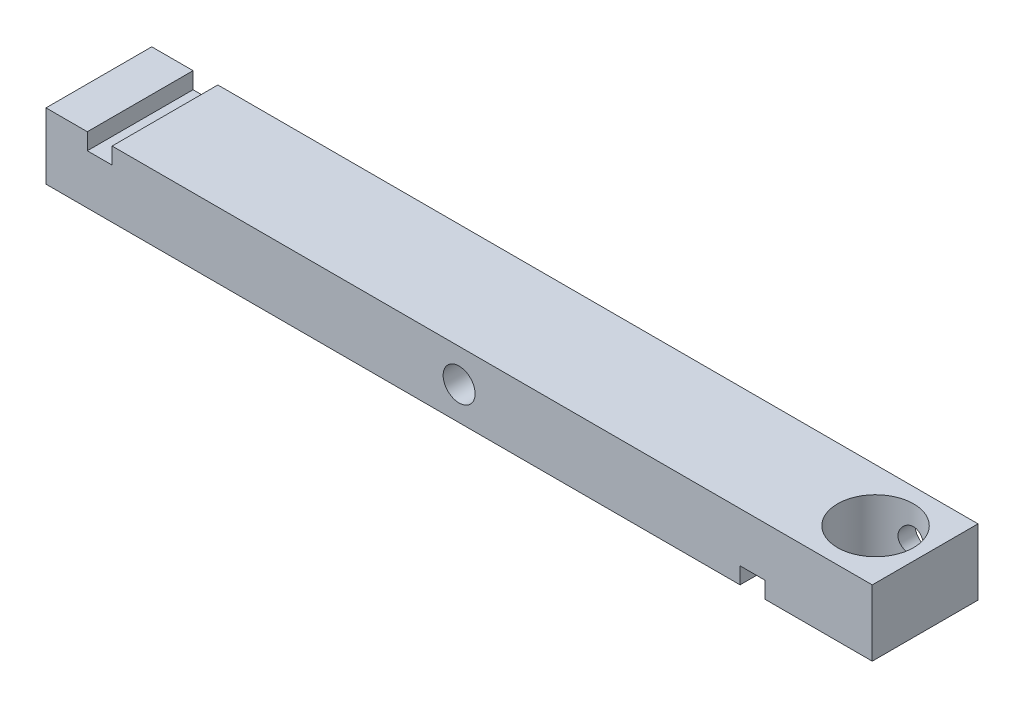
ISO-10303-21;
HEADER;
FILE_DESCRIPTION(('STEP AP214'),'2;1');
FILE_NAME('part.step','',(''),(''),'','','');
FILE_SCHEMA(('AUTOMOTIVE_DESIGN { 1 0 10303 214 1 1 1 1 }'));
ENDSEC;
DATA;
#1=APPLICATION_CONTEXT('core data for automotive mechanical design processes');
#2=APPLICATION_PROTOCOL_DEFINITION('international standard','automotive_design',2000,#1);
#3=PRODUCT_CONTEXT('',#1,'mechanical');
#4=PRODUCT('Part','Part','',(#3));
#5=PRODUCT_RELATED_PRODUCT_CATEGORY('part','',(#4));
#6=PRODUCT_DEFINITION_FORMATION('','',#4);
#7=PRODUCT_DEFINITION_CONTEXT('part definition',#1,'design');
#8=PRODUCT_DEFINITION('design','',#6,#7);
#9=PRODUCT_DEFINITION_SHAPE('','',#8);
#10=(LENGTH_UNIT() NAMED_UNIT(*) SI_UNIT(.MILLI.,.METRE.));
#11=(NAMED_UNIT(*) PLANE_ANGLE_UNIT() SI_UNIT($,.RADIAN.));
#12=(NAMED_UNIT(*) SI_UNIT($,.STERADIAN.) SOLID_ANGLE_UNIT());
#13=UNCERTAINTY_MEASURE_WITH_UNIT(LENGTH_MEASURE(1.E-05),#10,'distance_accuracy_value','');
#14=(GEOMETRIC_REPRESENTATION_CONTEXT(3) GLOBAL_UNCERTAINTY_ASSIGNED_CONTEXT((#13)) GLOBAL_UNIT_ASSIGNED_CONTEXT((#10,
#11,#12)) REPRESENTATION_CONTEXT('',''));
#15=CARTESIAN_POINT('',(0.,0.,0.));
#16=DIRECTION('',(0.,0.,1.));
#17=DIRECTION('',(1.,0.,0.));
#18=AXIS2_PLACEMENT_3D('',#15,#16,#17);
#19=CARTESIAN_POINT('',(-63.5,5.08,8.128));
#20=DIRECTION('',(0.,-1.,0.));
#21=DIRECTION('',(0.,0.,-1.));
#22=AXIS2_PLACEMENT_3D('',#19,#20,#21);
#23=PLANE('',#22);
#24=DIRECTION('',(-1.,0.,0.));
#25=VECTOR('',#24,1.);
#26=CARTESIAN_POINT('',(-63.5,5.08,8.128));
#27=LINE('',#26,#25);
#28=CARTESIAN_POINT('',(-57.15,5.08,8.128));
#29=VERTEX_POINT('',#28);
#30=CARTESIAN_POINT('',(-63.5,5.08,8.128));
#31=VERTEX_POINT('',#30);
#32=EDGE_CURVE('E221',#29,#31,#27,.T.);
#33=ORIENTED_EDGE('',*,*,#32,.F.);
#34=DIRECTION('',(0.,0.,1.));
#35=VECTOR('',#34,1.);
#36=CARTESIAN_POINT('',(-57.15,5.08,-12.7070501198393));
#37=LINE('',#36,#35);
#38=CARTESIAN_POINT('',(-57.15,5.08,-8.128));
#39=VERTEX_POINT('',#38);
#40=EDGE_CURVE('E168',#39,#29,#37,.T.);
#41=ORIENTED_EDGE('',*,*,#40,.F.);
#42=DIRECTION('',(-1.,0.,0.));
#43=VECTOR('',#42,1.);
#44=CARTESIAN_POINT('',(-63.5,5.08,-8.128));
#45=LINE('',#44,#43);
#46=CARTESIAN_POINT('',(-63.5,5.08,-8.128));
#47=VERTEX_POINT('',#46);
#48=EDGE_CURVE('E153',#39,#47,#45,.T.);
#49=ORIENTED_EDGE('',*,*,#48,.T.);
#50=DIRECTION('',(0.,0.,-1.));
#51=VECTOR('',#50,1.);
#52=CARTESIAN_POINT('',(-63.5,5.08,8.128));
#53=LINE('',#52,#51);
#54=EDGE_CURVE('E48',#31,#47,#53,.T.);
#55=ORIENTED_EDGE('',*,*,#54,.F.);
#56=EDGE_LOOP('',(#33,#41,#49,#55));
#57=FACE_BOUND('',#56,.T.);
#58=ADVANCED_FACE('F39',(#57),#23,.F.);
#59=CARTESIAN_POINT('',(-63.5,-5.08,8.128));
#60=DIRECTION('',(0.,1.,0.));
#61=DIRECTION('',(0.,0.,1.));
#62=AXIS2_PLACEMENT_3D('',#59,#60,#61);
#63=PLANE('',#62);
#64=DIRECTION('',(1.,0.,0.));
#65=VECTOR('',#64,1.);
#66=CARTESIAN_POINT('',(-63.5,-5.08,-8.128));
#67=LINE('',#66,#65);
#68=CARTESIAN_POINT('',(-63.5,-5.08,-8.128));
#69=VERTEX_POINT('',#68);
#70=CARTESIAN_POINT('',(43.18,-5.08,-8.128));
#71=VERTEX_POINT('',#70);
#72=EDGE_CURVE('E222',#69,#71,#67,.T.);
#73=ORIENTED_EDGE('',*,*,#72,.T.);
#74=DIRECTION('',(0.,0.,1.));
#75=VECTOR('',#74,1.);
#76=CARTESIAN_POINT('',(43.18,-5.08,-12.7070501198393));
#77=LINE('',#76,#75);
#78=CARTESIAN_POINT('',(43.18,-5.08,8.128));
#79=VERTEX_POINT('',#78);
#80=EDGE_CURVE('E189',#71,#79,#77,.T.);
#81=ORIENTED_EDGE('',*,*,#80,.T.);
#82=DIRECTION('',(1.,0.,0.));
#83=VECTOR('',#82,1.);
#84=CARTESIAN_POINT('',(-63.5,-5.08,8.128));
#85=LINE('',#84,#83);
#86=CARTESIAN_POINT('',(-63.5,-5.08,8.128));
#87=VERTEX_POINT('',#86);
#88=EDGE_CURVE('E231',#87,#79,#85,.T.);
#89=ORIENTED_EDGE('',*,*,#88,.F.);
#90=DIRECTION('',(0.,0.,-1.));
#91=VECTOR('',#90,1.);
#92=CARTESIAN_POINT('',(-63.5,-5.08,8.128));
#93=LINE('',#92,#91);
#94=EDGE_CURVE('E253',#87,#69,#93,.T.);
#95=ORIENTED_EDGE('',*,*,#94,.T.);
#96=EDGE_LOOP('',(#73,#81,#89,#95));
#97=FACE_BOUND('',#96,.T.);
#98=ADVANCED_FACE('F267',(#97),#63,.F.);
#99=CARTESIAN_POINT('',(63.5,-5.08,8.128));
#100=DIRECTION('',(-1.,0.,0.));
#101=DIRECTION('',(0.,0.,1.));
#102=AXIS2_PLACEMENT_3D('',#99,#100,#101);
#103=PLANE('',#102);
#104=DIRECTION('',(0.,1.,0.));
#105=VECTOR('',#104,1.);
#106=CARTESIAN_POINT('',(63.5,-5.08,-8.128));
#107=LINE('',#106,#105);
#108=CARTESIAN_POINT('',(63.5,-5.08,-8.128));
#109=VERTEX_POINT('',#108);
#110=CARTESIAN_POINT('',(63.5,5.08,-8.128));
#111=VERTEX_POINT('',#110);
#112=EDGE_CURVE('E216',#109,#111,#107,.T.);
#113=ORIENTED_EDGE('',*,*,#112,.T.);
#114=DIRECTION('',(0.,0.,-1.));
#115=VECTOR('',#114,1.);
#116=CARTESIAN_POINT('',(63.5,5.08,8.128));
#117=LINE('',#116,#115);
#118=CARTESIAN_POINT('',(63.5,5.08,8.128));
#119=VERTEX_POINT('',#118);
#120=EDGE_CURVE('E11',#119,#111,#117,.T.);
#121=ORIENTED_EDGE('',*,*,#120,.F.);
#122=DIRECTION('',(0.,1.,0.));
#123=VECTOR('',#122,1.);
#124=CARTESIAN_POINT('',(63.5,-5.08,8.128));
#125=LINE('',#124,#123);
#126=CARTESIAN_POINT('',(63.5,-5.08,8.128));
#127=VERTEX_POINT('',#126);
#128=EDGE_CURVE('E217',#127,#119,#125,.T.);
#129=ORIENTED_EDGE('',*,*,#128,.F.);
#130=DIRECTION('',(0.,0.,-1.));
#131=VECTOR('',#130,1.);
#132=CARTESIAN_POINT('',(63.5,-5.08,8.128));
#133=LINE('',#132,#131);
#134=EDGE_CURVE('E235',#127,#109,#133,.T.);
#135=ORIENTED_EDGE('',*,*,#134,.T.);
#136=EDGE_LOOP('',(#113,#121,#129,#135));
#137=FACE_BOUND('',#136,.T.);
#138=ADVANCED_FACE('F41',(#137),#103,.F.);
#139=CARTESIAN_POINT('',(55.88,5.08,0.));
#140=DIRECTION('',(0.,1.,0.));
#141=DIRECTION('',(0.,0.,1.));
#142=AXIS2_PLACEMENT_3D('',#139,#140,#141);
#143=CIRCLE('',#142,5.84200000000001);
#144=CARTESIAN_POINT('',(55.88,5.08,5.84200000000001));
#145=VERTEX_POINT('',#144);
#146=EDGE_CURVE('E295',#145,#145,#143,.T.);
#147=ORIENTED_EDGE('',*,*,#146,.F.);
#148=EDGE_LOOP('',(#147));
#149=FACE_BOUND('',#148,.T.);
#150=CARTESIAN_POINT('',(-53.34,5.08,-8.128));
#151=VERTEX_POINT('',#150);
#152=EDGE_CURVE('E239',#111,#151,#45,.T.);
#153=ORIENTED_EDGE('',*,*,#152,.T.);
#154=DIRECTION('',(0.,0.,1.));
#155=VECTOR('',#154,1.);
#156=CARTESIAN_POINT('',(-53.34,5.08,-12.7070501198393));
#157=LINE('',#156,#155);
#158=CARTESIAN_POINT('',(-53.34,5.08,8.128));
#159=VERTEX_POINT('',#158);
#160=EDGE_CURVE('E63',#151,#159,#157,.T.);
#161=ORIENTED_EDGE('',*,*,#160,.T.);
#162=EDGE_CURVE('E223',#119,#159,#27,.T.);
#163=ORIENTED_EDGE('',*,*,#162,.F.);
#164=ORIENTED_EDGE('',*,*,#120,.T.);
#165=EDGE_LOOP('',(#153,#161,#163,#164));
#166=FACE_BOUND('',#165,.T.);
#167=ADVANCED_FACE('F278',(#149,#166),#23,.F.);
#168=CARTESIAN_POINT('',(-63.5,-5.08,8.128));
#169=DIRECTION('',(1.,0.,0.));
#170=DIRECTION('',(0.,0.,-1.));
#171=AXIS2_PLACEMENT_3D('',#168,#169,#170);
#172=PLANE('',#171);
#173=DIRECTION('',(0.,-1.,0.));
#174=VECTOR('',#173,1.);
#175=CARTESIAN_POINT('',(-63.5,-5.08,-8.128));
#176=LINE('',#175,#174);
#177=EDGE_CURVE('E243',#47,#69,#176,.T.);
#178=ORIENTED_EDGE('',*,*,#177,.T.);
#179=ORIENTED_EDGE('',*,*,#94,.F.);
#180=DIRECTION('',(0.,-1.,0.));
#181=VECTOR('',#180,1.);
#182=CARTESIAN_POINT('',(-63.5,-5.08,8.128));
#183=LINE('',#182,#181);
#184=EDGE_CURVE('E227',#31,#87,#183,.T.);
#185=ORIENTED_EDGE('',*,*,#184,.F.);
#186=ORIENTED_EDGE('',*,*,#54,.T.);
#187=EDGE_LOOP('',(#178,#179,#185,#186));
#188=FACE_BOUND('',#187,.T.);
#189=ADVANCED_FACE('F261',(#188),#172,.F.);
#190=CARTESIAN_POINT('',(55.88,-5.08,0.));
#191=DIRECTION('',(0.,1.,0.));
#192=DIRECTION('',(0.,0.,1.));
#193=AXIS2_PLACEMENT_3D('',#190,#191,#192);
#194=CIRCLE('',#193,5.84200000000001);
#195=CARTESIAN_POINT('',(55.88,-5.08,5.84200000000001));
#196=VERTEX_POINT('',#195);
#197=EDGE_CURVE('E185',#196,#196,#194,.T.);
#198=ORIENTED_EDGE('',*,*,#197,.T.);
#199=EDGE_LOOP('',(#198));
#200=FACE_BOUND('',#199,.T.);
#201=CARTESIAN_POINT('',(46.99,-5.08,8.128));
#202=VERTEX_POINT('',#201);
#203=EDGE_CURVE('E230',#202,#127,#85,.T.);
#204=ORIENTED_EDGE('',*,*,#203,.F.);
#205=DIRECTION('',(0.,0.,1.));
#206=VECTOR('',#205,1.);
#207=CARTESIAN_POINT('',(46.99,-5.08,-12.7070501198393));
#208=LINE('',#207,#206);
#209=CARTESIAN_POINT('',(46.99,-5.08,-8.128));
#210=VERTEX_POINT('',#209);
#211=EDGE_CURVE('E199',#210,#202,#208,.T.);
#212=ORIENTED_EDGE('',*,*,#211,.F.);
#213=EDGE_CURVE('E246',#210,#109,#67,.T.);
#214=ORIENTED_EDGE('',*,*,#213,.T.);
#215=ORIENTED_EDGE('',*,*,#134,.F.);
#216=EDGE_LOOP('',(#204,#212,#214,#215));
#217=FACE_BOUND('',#216,.T.);
#218=ADVANCED_FACE('F283',(#200,#217),#63,.F.);
#219=CARTESIAN_POINT('',(0.,0.,8.128));
#220=DIRECTION('',(0.,0.,-1.));
#221=DIRECTION('',(-1.,0.,0.));
#222=AXIS2_PLACEMENT_3D('',#219,#220,#221);
#223=PLANE('',#222);
#224=DIRECTION('',(1.,0.,0.));
#225=VECTOR('',#224,1.);
#226=CARTESIAN_POINT('',(-57.15,2.54,8.128));
#227=LINE('',#226,#225);
#228=CARTESIAN_POINT('',(-57.15,2.54,8.128));
#229=VERTEX_POINT('',#228);
#230=CARTESIAN_POINT('',(-53.34,2.54,8.128));
#231=VERTEX_POINT('',#230);
#232=EDGE_CURVE('E158',#229,#231,#227,.T.);
#233=ORIENTED_EDGE('',*,*,#232,.F.);
#234=DIRECTION('',(0.,-1.,0.));
#235=VECTOR('',#234,1.);
#236=CARTESIAN_POINT('',(-57.15,5.08,8.128));
#237=LINE('',#236,#235);
#238=EDGE_CURVE('E145',#29,#229,#237,.T.);
#239=ORIENTED_EDGE('',*,*,#238,.F.);
#240=ORIENTED_EDGE('',*,*,#32,.T.);
#241=ORIENTED_EDGE('',*,*,#184,.T.);
#242=ORIENTED_EDGE('',*,*,#88,.T.);
#243=DIRECTION('',(0.,-1.,0.));
#244=VECTOR('',#243,1.);
#245=CARTESIAN_POINT('',(43.18,-2.54,8.128));
#246=LINE('',#245,#244);
#247=CARTESIAN_POINT('',(43.18,-2.54,8.128));
#248=VERTEX_POINT('',#247);
#249=EDGE_CURVE('E179',#248,#79,#246,.T.);
#250=ORIENTED_EDGE('',*,*,#249,.F.);
#251=DIRECTION('',(-1.,0.,0.));
#252=VECTOR('',#251,1.);
#253=CARTESIAN_POINT('',(43.18,-2.54,8.128));
#254=LINE('',#253,#252);
#255=CARTESIAN_POINT('',(46.99,-2.54,8.128));
#256=VERTEX_POINT('',#255);
#257=EDGE_CURVE('E182',#256,#248,#254,.T.);
#258=ORIENTED_EDGE('',*,*,#257,.F.);
#259=DIRECTION('',(0.,1.,0.));
#260=VECTOR('',#259,1.);
#261=CARTESIAN_POINT('',(46.99,-5.08,8.128));
#262=LINE('',#261,#260);
#263=EDGE_CURVE('E174',#202,#256,#262,.T.);
#264=ORIENTED_EDGE('',*,*,#263,.F.);
#265=ORIENTED_EDGE('',*,*,#203,.T.);
#266=ORIENTED_EDGE('',*,*,#128,.T.);
#267=ORIENTED_EDGE('',*,*,#162,.T.);
#268=DIRECTION('',(0.,1.,0.));
#269=VECTOR('',#268,1.);
#270=CARTESIAN_POINT('',(-53.34,2.54,8.128));
#271=LINE('',#270,#269);
#272=EDGE_CURVE('E155',#231,#159,#271,.T.);
#273=ORIENTED_EDGE('',*,*,#272,.F.);
#274=EDGE_LOOP('',(#233,#239,#240,#241,#242,#250,#258,#264,#265,#266,#267,#273));
#275=FACE_BOUND('',#274,.T.);
#276=CARTESIAN_POINT('',(0.,0.,8.128));
#277=DIRECTION('',(0.,0.,1.));
#278=DIRECTION('',(1.,0.,0.));
#279=AXIS2_PLACEMENT_3D('',#276,#277,#278);
#280=CIRCLE('',#279,2.45744999999999);
#281=CARTESIAN_POINT('',(2.45744999999999,0.,8.128));
#282=VERTEX_POINT('',#281);
#283=EDGE_CURVE('E173',#282,#282,#280,.T.);
#284=ORIENTED_EDGE('',*,*,#283,.F.);
#285=EDGE_LOOP('',(#284));
#286=FACE_BOUND('',#285,.T.);
#287=ADVANCED_FACE('F271',(#275,#286),#223,.F.);
#288=CARTESIAN_POINT('',(0.,0.,-8.128));
#289=DIRECTION('',(0.,0.,-1.));
#290=DIRECTION('',(-1.,0.,0.));
#291=AXIS2_PLACEMENT_3D('',#288,#289,#290);
#292=PLANE('',#291);
#293=CARTESIAN_POINT('',(55.88,0.,-8.128));
#294=DIRECTION('',(0.,0.,-1.));
#295=DIRECTION('',(-1.,0.,0.));
#296=AXIS2_PLACEMENT_3D('',#293,#294,#295);
#297=CIRCLE('',#296,2.032);
#298=CARTESIAN_POINT('',(53.848,0.,-8.128));
#299=VERTEX_POINT('',#298);
#300=EDGE_CURVE('E347',#299,#299,#297,.T.);
#301=ORIENTED_EDGE('',*,*,#300,.F.);
#302=EDGE_LOOP('',(#301));
#303=FACE_BOUND('',#302,.T.);
#304=DIRECTION('',(0.,-1.,0.));
#305=VECTOR('',#304,1.);
#306=CARTESIAN_POINT('',(-57.15,5.08,-8.128));
#307=LINE('',#306,#305);
#308=CARTESIAN_POINT('',(-57.15,2.54,-8.128));
#309=VERTEX_POINT('',#308);
#310=EDGE_CURVE('E142',#39,#309,#307,.T.);
#311=ORIENTED_EDGE('',*,*,#310,.T.);
#312=DIRECTION('',(1.,0.,0.));
#313=VECTOR('',#312,1.);
#314=CARTESIAN_POINT('',(-57.15,2.54,-8.128));
#315=LINE('',#314,#313);
#316=CARTESIAN_POINT('',(-53.34,2.54,-8.128));
#317=VERTEX_POINT('',#316);
#318=EDGE_CURVE('E129',#309,#317,#315,.T.);
#319=ORIENTED_EDGE('',*,*,#318,.T.);
#320=DIRECTION('',(0.,1.,0.));
#321=VECTOR('',#320,1.);
#322=CARTESIAN_POINT('',(-53.34,2.54,-8.128));
#323=LINE('',#322,#321);
#324=EDGE_CURVE('E163',#317,#151,#323,.T.);
#325=ORIENTED_EDGE('',*,*,#324,.T.);
#326=ORIENTED_EDGE('',*,*,#152,.F.);
#327=ORIENTED_EDGE('',*,*,#112,.F.);
#328=ORIENTED_EDGE('',*,*,#213,.F.);
#329=DIRECTION('',(0.,1.,0.));
#330=VECTOR('',#329,1.);
#331=CARTESIAN_POINT('',(46.99,-5.08,-8.128));
#332=LINE('',#331,#330);
#333=CARTESIAN_POINT('',(46.99,-2.54,-8.128));
#334=VERTEX_POINT('',#333);
#335=EDGE_CURVE('E195',#210,#334,#332,.T.);
#336=ORIENTED_EDGE('',*,*,#335,.T.);
#337=DIRECTION('',(-1.,0.,0.));
#338=VECTOR('',#337,1.);
#339=CARTESIAN_POINT('',(43.18,-2.54,-8.128));
#340=LINE('',#339,#338);
#341=CARTESIAN_POINT('',(43.18,-2.54,-8.128));
#342=VERTEX_POINT('',#341);
#343=EDGE_CURVE('E190',#334,#342,#340,.T.);
#344=ORIENTED_EDGE('',*,*,#343,.T.);
#345=DIRECTION('',(0.,-1.,0.));
#346=VECTOR('',#345,1.);
#347=CARTESIAN_POINT('',(43.18,-2.54,-8.128));
#348=LINE('',#347,#346);
#349=EDGE_CURVE('E178',#342,#71,#348,.T.);
#350=ORIENTED_EDGE('',*,*,#349,.T.);
#351=ORIENTED_EDGE('',*,*,#72,.F.);
#352=ORIENTED_EDGE('',*,*,#177,.F.);
#353=ORIENTED_EDGE('',*,*,#48,.F.);
#354=EDGE_LOOP('',(#311,#319,#325,#326,#327,#328,#336,#344,#350,#351,#352,#353));
#355=FACE_BOUND('',#354,.T.);
#356=CARTESIAN_POINT('',(0.,0.,-8.128));
#357=DIRECTION('',(0.,0.,1.));
#358=DIRECTION('',(1.,0.,0.));
#359=AXIS2_PLACEMENT_3D('',#356,#357,#358);
#360=CIRCLE('',#359,2.45745);
#361=CARTESIAN_POINT('',(2.45745,0.,-8.128));
#362=VERTEX_POINT('',#361);
#363=EDGE_CURVE('E212',#362,#362,#360,.T.);
#364=ORIENTED_EDGE('',*,*,#363,.T.);
#365=EDGE_LOOP('',(#364));
#366=FACE_BOUND('',#365,.T.);
#367=ADVANCED_FACE('F150',(#303,#355,#366),#292,.T.);
#368=CARTESIAN_POINT('',(0.,0.,8.128));
#369=DIRECTION('',(0.,0.,1.));
#370=DIRECTION('',(1.,0.,0.));
#371=AXIS2_PLACEMENT_3D('',#368,#369,#370);
#372=CYLINDRICAL_SURFACE('',#371,2.45744999999999);
#373=ORIENTED_EDGE('',*,*,#363,.F.);
#374=EDGE_LOOP('',(#373));
#375=FACE_BOUND('',#374,.T.);
#376=ORIENTED_EDGE('',*,*,#283,.T.);
#377=EDGE_LOOP('',(#376));
#378=FACE_BOUND('',#377,.T.);
#379=ADVANCED_FACE('F325',(#375,#378),#372,.F.);
#380=CARTESIAN_POINT('',(43.18,-2.54,-12.7070501198393));
#381=DIRECTION('',(-1.,0.,0.));
#382=DIRECTION('',(0.,0.,1.));
#383=AXIS2_PLACEMENT_3D('',#380,#381,#382);
#384=PLANE('',#383);
#385=DIRECTION('',(0.,0.,1.));
#386=VECTOR('',#385,1.);
#387=CARTESIAN_POINT('',(43.18,-2.54,-12.7070501198393));
#388=LINE('',#387,#386);
#389=EDGE_CURVE('E55',#342,#248,#388,.T.);
#390=ORIENTED_EDGE('',*,*,#389,.T.);
#391=ORIENTED_EDGE('',*,*,#249,.T.);
#392=ORIENTED_EDGE('',*,*,#80,.F.);
#393=ORIENTED_EDGE('',*,*,#349,.F.);
#394=EDGE_LOOP('',(#390,#391,#392,#393));
#395=FACE_BOUND('',#394,.T.);
#396=ADVANCED_FACE('F319',(#395),#384,.F.);
#397=CARTESIAN_POINT('',(46.99,-5.08,-12.7070501198393));
#398=DIRECTION('',(1.,0.,0.));
#399=DIRECTION('',(0.,0.,-1.));
#400=AXIS2_PLACEMENT_3D('',#397,#398,#399);
#401=PLANE('',#400);
#402=ORIENTED_EDGE('',*,*,#211,.T.);
#403=ORIENTED_EDGE('',*,*,#263,.T.);
#404=DIRECTION('',(0.,0.,1.));
#405=VECTOR('',#404,1.);
#406=CARTESIAN_POINT('',(46.99,-2.54,-12.7070501198393));
#407=LINE('',#406,#405);
#408=EDGE_CURVE('E194',#334,#256,#407,.T.);
#409=ORIENTED_EDGE('',*,*,#408,.F.);
#410=ORIENTED_EDGE('',*,*,#335,.F.);
#411=EDGE_LOOP('',(#402,#403,#409,#410));
#412=FACE_BOUND('',#411,.T.);
#413=ADVANCED_FACE('F310',(#412),#401,.F.);
#414=CARTESIAN_POINT('',(43.18,-2.54,-12.7070501198393));
#415=DIRECTION('',(0.,1.,0.));
#416=DIRECTION('',(0.,0.,1.));
#417=AXIS2_PLACEMENT_3D('',#414,#415,#416);
#418=PLANE('',#417);
#419=ORIENTED_EDGE('',*,*,#408,.T.);
#420=ORIENTED_EDGE('',*,*,#257,.T.);
#421=ORIENTED_EDGE('',*,*,#389,.F.);
#422=ORIENTED_EDGE('',*,*,#343,.F.);
#423=EDGE_LOOP('',(#419,#420,#421,#422));
#424=FACE_BOUND('',#423,.T.);
#425=ADVANCED_FACE('F311',(#424),#418,.F.);
#426=CARTESIAN_POINT('',(-57.15,5.08,-12.7070501198393));
#427=DIRECTION('',(-1.,0.,0.));
#428=DIRECTION('',(0.,0.,1.));
#429=AXIS2_PLACEMENT_3D('',#426,#427,#428);
#430=PLANE('',#429);
#431=ORIENTED_EDGE('',*,*,#40,.T.);
#432=ORIENTED_EDGE('',*,*,#238,.T.);
#433=DIRECTION('',(0.,0.,1.));
#434=VECTOR('',#433,1.);
#435=CARTESIAN_POINT('',(-57.15,2.54,-12.7070501198393));
#436=LINE('',#435,#434);
#437=EDGE_CURVE('E133',#309,#229,#436,.T.);
#438=ORIENTED_EDGE('',*,*,#437,.F.);
#439=ORIENTED_EDGE('',*,*,#310,.F.);
#440=EDGE_LOOP('',(#431,#432,#438,#439));
#441=FACE_BOUND('',#440,.T.);
#442=ADVANCED_FACE('F141',(#441),#430,.F.);
#443=CARTESIAN_POINT('',(-57.15,2.54,-12.7070501198393));
#444=DIRECTION('',(0.,-1.,0.));
#445=DIRECTION('',(0.,0.,-1.));
#446=AXIS2_PLACEMENT_3D('',#443,#444,#445);
#447=PLANE('',#446);
#448=ORIENTED_EDGE('',*,*,#437,.T.);
#449=ORIENTED_EDGE('',*,*,#232,.T.);
#450=DIRECTION('',(0.,0.,1.));
#451=VECTOR('',#450,1.);
#452=CARTESIAN_POINT('',(-53.34,2.54,-12.7070501198393));
#453=LINE('',#452,#451);
#454=EDGE_CURVE('E135',#317,#231,#453,.T.);
#455=ORIENTED_EDGE('',*,*,#454,.F.);
#456=ORIENTED_EDGE('',*,*,#318,.F.);
#457=EDGE_LOOP('',(#448,#449,#455,#456));
#458=FACE_BOUND('',#457,.T.);
#459=ADVANCED_FACE('F131',(#458),#447,.F.);
#460=CARTESIAN_POINT('',(-53.34,2.54,-12.7070501198393));
#461=DIRECTION('',(1.,0.,0.));
#462=DIRECTION('',(0.,0.,-1.));
#463=AXIS2_PLACEMENT_3D('',#460,#461,#462);
#464=PLANE('',#463);
#465=ORIENTED_EDGE('',*,*,#454,.T.);
#466=ORIENTED_EDGE('',*,*,#272,.T.);
#467=ORIENTED_EDGE('',*,*,#160,.F.);
#468=ORIENTED_EDGE('',*,*,#324,.F.);
#469=EDGE_LOOP('',(#465,#466,#467,#468));
#470=FACE_BOUND('',#469,.T.);
#471=ADVANCED_FACE('F299',(#470),#464,.F.);
#472=CARTESIAN_POINT('',(55.88,5.08,0.));
#473=DIRECTION('',(0.,1.,0.));
#474=DIRECTION('',(0.,0.,1.));
#475=AXIS2_PLACEMENT_3D('',#472,#473,#474);
#476=CYLINDRICAL_SURFACE('',#475,5.84200000000001);
#477=CARTESIAN_POINT('',(53.848,0.,-5.47722009782336));
#478=CARTESIAN_POINT('',(53.8479984015391,-0.110365710806322,-5.47721876100269));
#479=CARTESIAN_POINT('',(53.8570218372121,-0.220720291989214,-5.48059228994186));
#480=CARTESIAN_POINT('',(53.8927414380663,-0.438140400496522,-5.49364378417253));
#481=CARTESIAN_POINT('',(53.9194392559985,-0.545205619249199,-5.50332233905259));
#482=CARTESIAN_POINT('',(53.989440515386,-0.752857942474316,-5.52775780069164));
#483=CARTESIAN_POINT('',(54.0327090414497,-0.853458152086432,-5.54250402293562));
#484=CARTESIAN_POINT('',(54.1345025803409,-1.04600694971775,-5.57539720289215));
#485=CARTESIAN_POINT('',(54.193031406855,-1.13795336724794,-5.59354501037234));
#486=CARTESIAN_POINT('',(54.3263579991518,-1.31450592648072,-5.63206433030409));
#487=CARTESIAN_POINT('',(54.401698204726,-1.39868968868128,-5.65249475450469));
#488=CARTESIAN_POINT('',(54.5653535390261,-1.55351898261276,-5.6927816209305));
#489=CARTESIAN_POINT('',(54.6536709616757,-1.62416211573009,-5.71263796093329));
#490=CARTESIAN_POINT('',(54.8439017367089,-1.75186051993941,-5.75022753390276));
#491=CARTESIAN_POINT('',(54.9461325213831,-1.80846768248609,-5.76788348768608));
#492=CARTESIAN_POINT('',(55.1593861287127,-1.90351123302395,-5.79838416782479));
#493=CARTESIAN_POINT('',(55.2704063454397,-1.94195298339369,-5.81123031378911));
#494=CARTESIAN_POINT('',(55.4936546583322,-1.99812582355423,-5.83024640170662));
#495=CARTESIAN_POINT('',(55.6056801682067,-2.01658168584275,-5.83664933544035));
#496=CARTESIAN_POINT('',(55.8314088571467,-2.03456932430115,-5.84288766352373));
#497=CARTESIAN_POINT('',(55.9451115572559,-2.034106402399,-5.84272489788952));
#498=CARTESIAN_POINT('',(56.1658153990624,-2.01471674926524,-5.83600482969316));
#499=CARTESIAN_POINT('',(56.2728955126361,-1.9965784762321,-5.82972059684521));
#500=CARTESIAN_POINT('',(56.482384527363,-1.94366436431071,-5.81181167532895));
#501=CARTESIAN_POINT('',(56.5847931050667,-1.90888737529415,-5.80018661748568));
#502=CARTESIAN_POINT('',(56.7836875434171,-1.82325520964461,-5.77256794371316));
#503=CARTESIAN_POINT('',(56.880073033177,-1.77218627423726,-5.75651665645631));
#504=CARTESIAN_POINT('',(57.0631303850326,-1.65560001421145,-5.72170092482545));
#505=CARTESIAN_POINT('',(57.149799373828,-1.59007843265952,-5.70293568163517));
#506=CARTESIAN_POINT('',(57.3156410880022,-1.44253069600033,-5.66352667203185));
#507=CARTESIAN_POINT('',(57.3942065111471,-1.35983348981872,-5.64283590840276));
#508=CARTESIAN_POINT('',(57.5365615720251,-1.18227700415136,-5.6027003512851));
#509=CARTESIAN_POINT('',(57.6003484916418,-1.08741549233832,-5.58325578747713));
#510=CARTESIAN_POINT('',(57.712279754241,-0.886142709115819,-5.54754337341992));
#511=CARTESIAN_POINT('',(57.7601444846035,-0.779564733586037,-5.53133412464496));
#512=CARTESIAN_POINT('',(57.8370329800975,-0.559152980272897,-5.50460376415016));
#513=CARTESIAN_POINT('',(57.866065491602,-0.445322597789621,-5.49408001225714));
#514=CARTESIAN_POINT('',(57.9031807432765,-0.219563045580665,-5.48051799088895));
#515=CARTESIAN_POINT('',(57.9122132066447,-0.107810409458602,-5.47714073447279));
#516=CARTESIAN_POINT('',(57.9117792498184,0.115640870006295,-5.47730225970221));
#517=CARTESIAN_POINT('',(57.9023165845114,0.227339519704443,-5.48083963753629));
#518=CARTESIAN_POINT('',(57.8660172500611,0.443013841878156,-5.49409168946826));
#519=CARTESIAN_POINT('',(57.8398645354737,0.547121233378067,-5.50356292763234));
#520=CARTESIAN_POINT('',(57.7717614155048,0.749440965590265,-5.52734064118636));
#521=CARTESIAN_POINT('',(57.7298080568437,0.847652200277778,-5.54164802044239));
#522=CARTESIAN_POINT('',(57.6296885474297,1.03907332534797,-5.57408328782847));
#523=CARTESIAN_POINT('',(57.5710225017722,1.13200211625994,-5.59232392794172));
#524=CARTESIAN_POINT('',(57.4396974624862,1.30703780111288,-5.63036183391595));
#525=CARTESIAN_POINT('',(57.3670339970659,1.38914122248737,-5.6501595960355));
#526=CARTESIAN_POINT('',(57.2051979712456,1.54470958809648,-5.69035294025018));
#527=CARTESIAN_POINT('',(57.1153534285468,1.61748387141074,-5.7107244048929));
#528=CARTESIAN_POINT('',(56.9242245886071,1.74698043423474,-5.7487424267241));
#529=CARTESIAN_POINT('',(56.8229405781522,1.80370311603136,-5.76638905219774));
#530=CARTESIAN_POINT('',(56.6121911976983,1.89900265833049,-5.79690589637341));
#531=CARTESIAN_POINT('',(56.5027767955566,1.93768305972993,-5.80980327774488));
#532=CARTESIAN_POINT('',(56.2784534785509,1.9959138612935,-5.82948126848644));
#533=CARTESIAN_POINT('',(56.1635467634847,2.01547185418656,-5.83626430552984));
#534=CARTESIAN_POINT('',(55.9377911526908,2.03417242734203,-5.84275012685841));
#535=CARTESIAN_POINT('',(55.8270330770935,2.03430266453641,-5.84279543927022));
#536=CARTESIAN_POINT('',(55.6071462096715,2.01661536269177,-5.83666074942288));
#537=CARTESIAN_POINT('',(55.4980172662911,1.99879950384181,-5.83048132994932));
#538=CARTESIAN_POINT('',(55.2865193568688,1.94639645134507,-5.81272830587073));
#539=CARTESIAN_POINT('',(55.1840624933961,1.91212682713351,-5.80125699643119));
#540=CARTESIAN_POINT('',(54.9863224565249,1.82808974344425,-5.77410390498085));
#541=CARTESIAN_POINT('',(54.8910406170864,1.77831941090978,-5.75842134248848));
#542=CARTESIAN_POINT('',(54.7063092117159,1.66247375270699,-5.72368706926942));
#543=CARTESIAN_POINT('',(54.6172305738238,1.59583959671433,-5.70452805059283));
#544=CARTESIAN_POINT('',(54.451201876176,1.44908406874988,-5.66522657001283));
#545=CARTESIAN_POINT('',(54.3742558724006,1.36895820488805,-5.64508378216708));
#546=CARTESIAN_POINT('',(54.2312462884323,1.1933185903445,-5.60502778206947));
#547=CARTESIAN_POINT('',(54.1658044990807,1.0972857448161,-5.5851629880625));
#548=CARTESIAN_POINT('',(54.0520128787927,0.894958786690326,-5.54896465038015));
#549=CARTESIAN_POINT('',(54.0036605251048,0.788666191594487,-5.53263058563502));
#550=CARTESIAN_POINT('',(53.9263300442034,0.570424412448759,-5.50579700725414));
#551=CARTESIAN_POINT('',(53.8970606635574,0.458589731823712,-5.49521021644686));
#552=CARTESIAN_POINT('',(53.8579006839696,0.231164864223253,-5.48092395635631));
#553=CARTESIAN_POINT('',(53.848001673928,0.115576329440862,-5.47722149775841));
#554=CARTESIAN_POINT('',(53.848,0.,-5.47722009782336));
#555=B_SPLINE_CURVE_WITH_KNOTS('',3,(#477,#478,#479,#480,#481,#482,#483,#484,#485,#486,#487,
#488,#489,#490,#491,#492,#493,#494,#495,#496,#497,#498,#499,#500,#501,#502,#503,#504,#505,#506,
#507,#508,#509,#510,#511,#512,#513,#514,#515,#516,#517,#518,#519,#520,#521,#522,#523,#524,#525,
#526,#527,#528,#529,#530,#531,#532,#533,#534,#535,#536,#537,#538,#539,#540,#541,#542,#543,#544,
#545,#546,#547,#548,#549,#550,#551,#552,#553,#554),.UNSPECIFIED.,.T.,.F.,(4,2,2,2,2,2,2,2,2,2,2,
2,2,2,2,2,2,2,2,2,2,2,2,2,2,2,2,2,2,2,2,2,2,2,2,2,2,2,4),(0.,0.330668330179202,
0.661367585885509,0.991373840050586,1.32146264493197,1.66433966458429,2.00727736612538,
2.36005638569274,2.71273120072973,3.05213754431365,3.39144877102192,3.71628590443707,
4.04114549501639,4.37045598194574,4.69986359498008,5.04606225923347,5.39232454715175,
5.74438094858888,6.09627372482797,6.43106183440519,6.76578198224083,7.08759637170782,
7.40947094099412,7.7422208218509,8.07507718400086,8.42561700354278,8.77614803704174,
9.12464191570361,9.47299736539033,9.803636960273,10.1342456021619,10.4587151821744,
10.7832449384609,11.1203957454477,11.4576590252025,11.8096470299364,12.161583052288,
12.5080134557973,12.8542933971418),.UNSPECIFIED.);
#556=CARTESIAN_POINT('',(53.848,0.,-5.47722009782336));
#557=VERTEX_POINT('',#556);
#558=EDGE_CURVE('E344',#557,#557,#555,.T.);
#559=ORIENTED_EDGE('',*,*,#558,.F.);
#560=EDGE_LOOP('',(#559));
#561=FACE_BOUND('',#560,.T.);
#562=ORIENTED_EDGE('',*,*,#197,.F.);
#563=EDGE_LOOP('',(#562));
#564=FACE_BOUND('',#563,.T.);
#565=ORIENTED_EDGE('',*,*,#146,.T.);
#566=EDGE_LOOP('',(#565));
#567=FACE_BOUND('',#566,.T.);
#568=ADVANCED_FACE('F363',(#561,#564,#567),#476,.F.);
#569=CARTESIAN_POINT('',(55.88,0.,-8.128));
#570=DIRECTION('',(0.,0.,-1.));
#571=DIRECTION('',(-1.,0.,0.));
#572=AXIS2_PLACEMENT_3D('',#569,#570,#571);
#573=CYLINDRICAL_SURFACE('',#572,2.032);
#574=ORIENTED_EDGE('',*,*,#558,.T.);
#575=EDGE_LOOP('',(#574));
#576=FACE_BOUND('',#575,.T.);
#577=ORIENTED_EDGE('',*,*,#300,.T.);
#578=EDGE_LOOP('',(#577));
#579=FACE_BOUND('',#578,.T.);
#580=ADVANCED_FACE('F358',(#576,#579),#573,.F.);
#581=CLOSED_SHELL('',(#58,#98,#138,#167,#189,#218,#287,#367,#379,#396,#413,#425,#442,#459,#471,
#568,#580));
#582=MANIFOLD_SOLID_BREP('B2',#581);
#583=ADVANCED_BREP_SHAPE_REPRESENTATION('',(#18,#582),#14);
#584=SHAPE_DEFINITION_REPRESENTATION(#9,#583);
ENDSEC;
END-ISO-10303-21;
